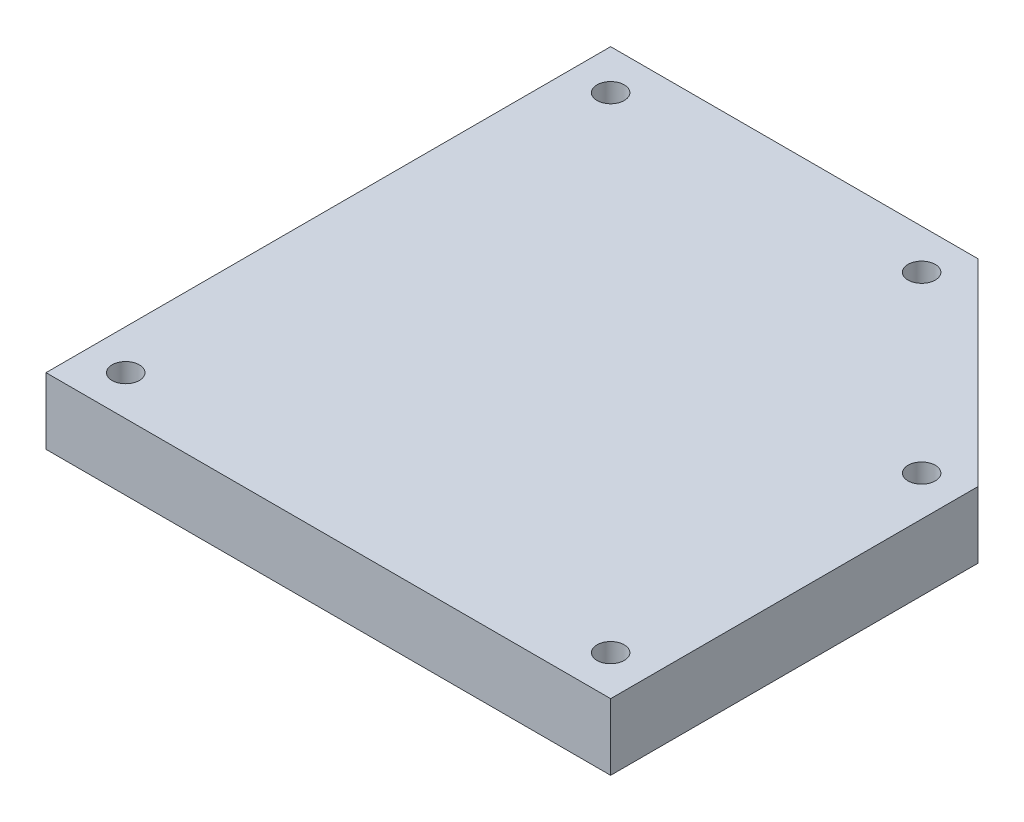
ISO-10303-21;
HEADER;
FILE_DESCRIPTION(('STEP AP214'),'2;1');
FILE_NAME('part.step','',(''),(''),'','','');
FILE_SCHEMA(('AUTOMOTIVE_DESIGN { 1 0 10303 214 1 1 1 1 }'));
ENDSEC;
DATA;
#1=APPLICATION_CONTEXT('core data for automotive mechanical design processes');
#2=APPLICATION_PROTOCOL_DEFINITION('international standard','automotive_design',2000,#1);
#3=PRODUCT_CONTEXT('',#1,'mechanical');
#4=PRODUCT('Part','Part','',(#3));
#5=PRODUCT_RELATED_PRODUCT_CATEGORY('part','',(#4));
#6=PRODUCT_DEFINITION_FORMATION('','',#4);
#7=PRODUCT_DEFINITION_CONTEXT('part definition',#1,'design');
#8=PRODUCT_DEFINITION('design','',#6,#7);
#9=PRODUCT_DEFINITION_SHAPE('','',#8);
#10=(LENGTH_UNIT() NAMED_UNIT(*) SI_UNIT(.MILLI.,.METRE.));
#11=(NAMED_UNIT(*) PLANE_ANGLE_UNIT() SI_UNIT($,.RADIAN.));
#12=(NAMED_UNIT(*) SI_UNIT($,.STERADIAN.) SOLID_ANGLE_UNIT());
#13=UNCERTAINTY_MEASURE_WITH_UNIT(LENGTH_MEASURE(1.E-05),#10,'distance_accuracy_value','');
#14=(GEOMETRIC_REPRESENTATION_CONTEXT(3) GLOBAL_UNCERTAINTY_ASSIGNED_CONTEXT((#13)) GLOBAL_UNIT_ASSIGNED_CONTEXT((#10,
#11,#12)) REPRESENTATION_CONTEXT('',''));
#15=CARTESIAN_POINT('',(0.,0.,0.));
#16=DIRECTION('',(0.,0.,1.));
#17=DIRECTION('',(1.,0.,0.));
#18=AXIS2_PLACEMENT_3D('',#15,#16,#17);
#19=CARTESIAN_POINT('',(-35.1601317484179,-0.000999999999999265,59.2039366352847));
#20=DIRECTION('',(0.,1.,0.));
#21=DIRECTION('',(0.,0.,1.));
#22=AXIS2_PLACEMENT_3D('',#19,#20,#21);
#23=CYLINDRICAL_SURFACE('',#22,2.05);
#24=CARTESIAN_POINT('',(-35.1601317484179,10.,59.2039366352847));
#25=DIRECTION('',(0.,1.,0.));
#26=DIRECTION('',(0.,0.,1.));
#27=AXIS2_PLACEMENT_3D('',#24,#25,#26);
#28=CIRCLE('',#27,2.05);
#29=CARTESIAN_POINT('',(-35.1601317484179,10.,61.2539366352847));
#30=VERTEX_POINT('',#29);
#31=EDGE_CURVE('E171',#30,#30,#28,.T.);
#32=ORIENTED_EDGE('',*,*,#31,.T.);
#33=EDGE_LOOP('',(#32));
#34=FACE_BOUND('',#33,.T.);
#35=CARTESIAN_POINT('',(-35.1601317484179,5.,59.2039366352847));
#36=DIRECTION('',(0.,-1.,0.));
#37=DIRECTION('',(0.,0.,-1.));
#38=AXIS2_PLACEMENT_3D('',#35,#36,#37);
#39=CIRCLE('',#38,2.05);
#40=CARTESIAN_POINT('',(-35.1601317484179,5.,57.1539366352847));
#41=VERTEX_POINT('',#40);
#42=EDGE_CURVE('E37',#41,#41,#39,.F.);
#43=ORIENTED_EDGE('',*,*,#42,.F.);
#44=EDGE_LOOP('',(#43));
#45=FACE_BOUND('',#44,.T.);
#46=ADVANCED_FACE('F33',(#34,#45),#23,.F.);
#47=CARTESIAN_POINT('',(-35.1601317484179,-0.000999999999999265,-13.7960633647153));
#48=DIRECTION('',(0.,1.,0.));
#49=DIRECTION('',(0.,0.,1.));
#50=AXIS2_PLACEMENT_3D('',#47,#48,#49);
#51=CYLINDRICAL_SURFACE('',#50,2.05);
#52=CARTESIAN_POINT('',(-35.1601317484179,10.,-13.7960633647153));
#53=DIRECTION('',(0.,1.,0.));
#54=DIRECTION('',(0.,0.,1.));
#55=AXIS2_PLACEMENT_3D('',#52,#53,#54);
#56=CIRCLE('',#55,2.05);
#57=CARTESIAN_POINT('',(-35.1601317484179,10.,-11.7460633647153));
#58=VERTEX_POINT('',#57);
#59=EDGE_CURVE('E168',#58,#58,#56,.T.);
#60=ORIENTED_EDGE('',*,*,#59,.T.);
#61=EDGE_LOOP('',(#60));
#62=FACE_BOUND('',#61,.T.);
#63=CARTESIAN_POINT('',(-35.1601317484179,5.,-13.7960633647153));
#64=DIRECTION('',(0.,-1.,0.));
#65=DIRECTION('',(0.,0.,-1.));
#66=AXIS2_PLACEMENT_3D('',#63,#64,#65);
#67=CIRCLE('',#66,2.05);
#68=CARTESIAN_POINT('',(-35.1601317484179,5.,-15.8460633647153));
#69=VERTEX_POINT('',#68);
#70=EDGE_CURVE('E137',#69,#69,#67,.F.);
#71=ORIENTED_EDGE('',*,*,#70,.F.);
#72=EDGE_LOOP('',(#71));
#73=FACE_BOUND('',#72,.T.);
#74=ADVANCED_FACE('F204',(#62,#73),#51,.F.);
#75=CARTESIAN_POINT('',(11.6561020675084,-0.000999999999999265,-13.7960633647153));
#76=DIRECTION('',(0.,1.,0.));
#77=DIRECTION('',(0.,0.,1.));
#78=AXIS2_PLACEMENT_3D('',#75,#76,#77);
#79=CYLINDRICAL_SURFACE('',#78,2.05);
#80=CARTESIAN_POINT('',(11.6561020675084,10.,-13.7960633647153));
#81=DIRECTION('',(0.,1.,0.));
#82=DIRECTION('',(0.,0.,1.));
#83=AXIS2_PLACEMENT_3D('',#80,#81,#82);
#84=CIRCLE('',#83,2.05);
#85=CARTESIAN_POINT('',(11.6561020675084,10.,-11.7460633647153));
#86=VERTEX_POINT('',#85);
#87=EDGE_CURVE('E126',#86,#86,#84,.T.);
#88=ORIENTED_EDGE('',*,*,#87,.T.);
#89=EDGE_LOOP('',(#88));
#90=FACE_BOUND('',#89,.T.);
#91=CARTESIAN_POINT('',(11.6561020675084,5.,-13.7960633647153));
#92=DIRECTION('',(0.,-1.,0.));
#93=DIRECTION('',(0.,0.,-1.));
#94=AXIS2_PLACEMENT_3D('',#91,#92,#93);
#95=CIRCLE('',#94,2.05);
#96=CARTESIAN_POINT('',(11.6561020675084,5.,-15.8460633647153));
#97=VERTEX_POINT('',#96);
#98=EDGE_CURVE('E133',#97,#97,#95,.F.);
#99=ORIENTED_EDGE('',*,*,#98,.F.);
#100=EDGE_LOOP('',(#99));
#101=FACE_BOUND('',#100,.T.);
#102=ADVANCED_FACE('F210',(#90,#101),#79,.F.);
#103=CARTESIAN_POINT('',(37.8398682515821,-0.000999999999999265,12.3877028193583));
#104=DIRECTION('',(0.,1.,0.));
#105=DIRECTION('',(0.,0.,1.));
#106=AXIS2_PLACEMENT_3D('',#103,#104,#105);
#107=CYLINDRICAL_SURFACE('',#106,2.05);
#108=CARTESIAN_POINT('',(37.8398682515821,10.,12.3877028193583));
#109=DIRECTION('',(0.,1.,0.));
#110=DIRECTION('',(0.,0.,1.));
#111=AXIS2_PLACEMENT_3D('',#108,#109,#110);
#112=CIRCLE('',#111,2.05);
#113=CARTESIAN_POINT('',(37.8398682515821,10.,14.4377028193583));
#114=VERTEX_POINT('',#113);
#115=EDGE_CURVE('E114',#114,#114,#112,.T.);
#116=ORIENTED_EDGE('',*,*,#115,.T.);
#117=EDGE_LOOP('',(#116));
#118=FACE_BOUND('',#117,.T.);
#119=CARTESIAN_POINT('',(37.8398682515821,5.,12.3877028193583));
#120=DIRECTION('',(0.,-1.,0.));
#121=DIRECTION('',(0.,0.,-1.));
#122=AXIS2_PLACEMENT_3D('',#119,#120,#121);
#123=CIRCLE('',#122,2.05);
#124=CARTESIAN_POINT('',(37.8398682515821,5.,10.3377028193583));
#125=VERTEX_POINT('',#124);
#126=EDGE_CURVE('E128',#125,#125,#123,.F.);
#127=ORIENTED_EDGE('',*,*,#126,.F.);
#128=EDGE_LOOP('',(#127));
#129=FACE_BOUND('',#128,.T.);
#130=ADVANCED_FACE('F219',(#118,#129),#107,.F.);
#131=CARTESIAN_POINT('',(37.8398682515821,-0.000999999999999265,59.2039366352847));
#132=DIRECTION('',(0.,1.,0.));
#133=DIRECTION('',(0.,0.,1.));
#134=AXIS2_PLACEMENT_3D('',#131,#132,#133);
#135=CYLINDRICAL_SURFACE('',#134,2.05);
#136=CARTESIAN_POINT('',(37.8398682515821,10.,59.2039366352847));
#137=DIRECTION('',(0.,1.,0.));
#138=DIRECTION('',(0.,0.,1.));
#139=AXIS2_PLACEMENT_3D('',#136,#137,#138);
#140=CIRCLE('',#139,2.05);
#141=CARTESIAN_POINT('',(37.8398682515821,10.,61.2539366352847));
#142=VERTEX_POINT('',#141);
#143=EDGE_CURVE('E174',#142,#142,#140,.T.);
#144=ORIENTED_EDGE('',*,*,#143,.T.);
#145=EDGE_LOOP('',(#144));
#146=FACE_BOUND('',#145,.T.);
#147=CARTESIAN_POINT('',(37.8398682515821,5.,59.2039366352847));
#148=DIRECTION('',(0.,-1.,0.));
#149=DIRECTION('',(0.,0.,-1.));
#150=AXIS2_PLACEMENT_3D('',#147,#148,#149);
#151=CIRCLE('',#150,2.05);
#152=CARTESIAN_POINT('',(37.8398682515821,5.,57.1539366352847));
#153=VERTEX_POINT('',#152);
#154=EDGE_CURVE('E123',#153,#153,#151,.F.);
#155=ORIENTED_EDGE('',*,*,#154,.F.);
#156=EDGE_LOOP('',(#155));
#157=FACE_BOUND('',#156,.T.);
#158=ADVANCED_FACE('F216',(#146,#157),#135,.F.);
#159=CARTESIAN_POINT('',(14.1413834417472,10.,-19.7960633647153));
#160=DIRECTION('',(0.,0.,1.));
#161=DIRECTION('',(1.,0.,0.));
#162=AXIS2_PLACEMENT_3D('',#159,#160,#161);
#163=PLANE('',#162);
#164=DIRECTION('',(-1.,0.,0.));
#165=VECTOR('',#164,1.);
#166=CARTESIAN_POINT('',(14.1413834417472,0.,-19.7960633647153));
#167=LINE('',#166,#165);
#168=CARTESIAN_POINT('',(14.1413834417472,0.,-19.7960633647153));
#169=VERTEX_POINT('',#168);
#170=CARTESIAN_POINT('',(-41.1601317484179,0.,-19.7960633647153));
#171=VERTEX_POINT('',#170);
#172=EDGE_CURVE('E110',#169,#171,#167,.T.);
#173=ORIENTED_EDGE('',*,*,#172,.T.);
#174=DIRECTION('',(0.,-1.,0.));
#175=VECTOR('',#174,1.);
#176=CARTESIAN_POINT('',(-41.1601317484179,10.,-19.7960633647153));
#177=LINE('',#176,#175);
#178=CARTESIAN_POINT('',(-41.1601317484179,10.,-19.7960633647153));
#179=VERTEX_POINT('',#178);
#180=EDGE_CURVE('E11',#179,#171,#177,.T.);
#181=ORIENTED_EDGE('',*,*,#180,.F.);
#182=DIRECTION('',(-1.,0.,0.));
#183=VECTOR('',#182,1.);
#184=CARTESIAN_POINT('',(14.1413834417472,10.,-19.7960633647153));
#185=LINE('',#184,#183);
#186=CARTESIAN_POINT('',(14.1413834417472,10.,-19.7960633647153));
#187=VERTEX_POINT('',#186);
#188=EDGE_CURVE('E119',#187,#179,#185,.T.);
#189=ORIENTED_EDGE('',*,*,#188,.F.);
#190=DIRECTION('',(0.,-1.,0.));
#191=VECTOR('',#190,1.);
#192=CARTESIAN_POINT('',(14.1413834417472,10.,-19.7960633647153));
#193=LINE('',#192,#191);
#194=EDGE_CURVE('E106',#187,#169,#193,.T.);
#195=ORIENTED_EDGE('',*,*,#194,.T.);
#196=EDGE_LOOP('',(#173,#181,#189,#195));
#197=FACE_BOUND('',#196,.T.);
#198=ADVANCED_FACE('F35',(#197),#163,.F.);
#199=CARTESIAN_POINT('',(-41.1601317484179,10.,-19.7960633647153));
#200=DIRECTION('',(1.,0.,0.));
#201=DIRECTION('',(0.,0.,-1.));
#202=AXIS2_PLACEMENT_3D('',#199,#200,#201);
#203=PLANE('',#202);
#204=DIRECTION('',(0.,0.,1.));
#205=VECTOR('',#204,1.);
#206=CARTESIAN_POINT('',(-41.1601317484179,0.,-19.7960633647153));
#207=LINE('',#206,#205);
#208=CARTESIAN_POINT('',(-41.1601317484179,0.,65.2039366352847));
#209=VERTEX_POINT('',#208);
#210=EDGE_CURVE('E113',#171,#209,#207,.T.);
#211=ORIENTED_EDGE('',*,*,#210,.T.);
#212=DIRECTION('',(0.,-1.,0.));
#213=VECTOR('',#212,1.);
#214=CARTESIAN_POINT('',(-41.1601317484179,10.,65.2039366352847));
#215=LINE('',#214,#213);
#216=CARTESIAN_POINT('',(-41.1601317484179,10.,65.2039366352847));
#217=VERTEX_POINT('',#216);
#218=EDGE_CURVE('E43',#217,#209,#215,.T.);
#219=ORIENTED_EDGE('',*,*,#218,.F.);
#220=DIRECTION('',(0.,0.,1.));
#221=VECTOR('',#220,1.);
#222=CARTESIAN_POINT('',(-41.1601317484179,10.,-19.7960633647153));
#223=LINE('',#222,#221);
#224=EDGE_CURVE('E86',#179,#217,#223,.T.);
#225=ORIENTED_EDGE('',*,*,#224,.F.);
#226=ORIENTED_EDGE('',*,*,#180,.T.);
#227=EDGE_LOOP('',(#211,#219,#225,#226));
#228=FACE_BOUND('',#227,.T.);
#229=ADVANCED_FACE('F183',(#228),#203,.F.);
#230=CARTESIAN_POINT('',(-41.1601317484179,10.,65.2039366352847));
#231=DIRECTION('',(0.,0.,-1.));
#232=DIRECTION('',(-1.,0.,0.));
#233=AXIS2_PLACEMENT_3D('',#230,#231,#232);
#234=PLANE('',#233);
#235=DIRECTION('',(1.,0.,0.));
#236=VECTOR('',#235,1.);
#237=CARTESIAN_POINT('',(-41.1601317484179,0.,65.2039366352847));
#238=LINE('',#237,#236);
#239=CARTESIAN_POINT('',(43.8398682515821,0.,65.2039366352847));
#240=VERTEX_POINT('',#239);
#241=EDGE_CURVE('E101',#209,#240,#238,.T.);
#242=ORIENTED_EDGE('',*,*,#241,.T.);
#243=DIRECTION('',(0.,-1.,0.));
#244=VECTOR('',#243,1.);
#245=CARTESIAN_POINT('',(43.8398682515821,10.,65.2039366352847));
#246=LINE('',#245,#244);
#247=CARTESIAN_POINT('',(43.8398682515821,10.,65.2039366352847));
#248=VERTEX_POINT('',#247);
#249=EDGE_CURVE('E98',#248,#240,#246,.T.);
#250=ORIENTED_EDGE('',*,*,#249,.F.);
#251=DIRECTION('',(1.,0.,0.));
#252=VECTOR('',#251,1.);
#253=CARTESIAN_POINT('',(-41.1601317484179,10.,65.2039366352847));
#254=LINE('',#253,#252);
#255=EDGE_CURVE('E90',#217,#248,#254,.T.);
#256=ORIENTED_EDGE('',*,*,#255,.F.);
#257=ORIENTED_EDGE('',*,*,#218,.T.);
#258=EDGE_LOOP('',(#242,#250,#256,#257));
#259=FACE_BOUND('',#258,.T.);
#260=ADVANCED_FACE('F99',(#259),#234,.F.);
#261=CARTESIAN_POINT('',(43.8398682515821,10.,65.2039366352847));
#262=DIRECTION('',(-1.,0.,0.));
#263=DIRECTION('',(0.,0.,1.));
#264=AXIS2_PLACEMENT_3D('',#261,#262,#263);
#265=PLANE('',#264);
#266=DIRECTION('',(0.,0.,-1.));
#267=VECTOR('',#266,1.);
#268=CARTESIAN_POINT('',(43.8398682515821,0.,65.2039366352847));
#269=LINE('',#268,#267);
#270=CARTESIAN_POINT('',(43.8398682515821,0.,9.90242144511974));
#271=VERTEX_POINT('',#270);
#272=EDGE_CURVE('E72',#240,#271,#269,.T.);
#273=ORIENTED_EDGE('',*,*,#272,.T.);
#274=DIRECTION('',(0.,-1.,0.));
#275=VECTOR('',#274,1.);
#276=CARTESIAN_POINT('',(43.8398682515821,10.,9.90242144511974));
#277=LINE('',#276,#275);
#278=CARTESIAN_POINT('',(43.8398682515821,10.,9.90242144511974));
#279=VERTEX_POINT('',#278);
#280=EDGE_CURVE('E102',#279,#271,#277,.T.);
#281=ORIENTED_EDGE('',*,*,#280,.F.);
#282=DIRECTION('',(0.,0.,-1.));
#283=VECTOR('',#282,1.);
#284=CARTESIAN_POINT('',(43.8398682515821,10.,65.2039366352847));
#285=LINE('',#284,#283);
#286=EDGE_CURVE('E94',#248,#279,#285,.T.);
#287=ORIENTED_EDGE('',*,*,#286,.F.);
#288=ORIENTED_EDGE('',*,*,#249,.T.);
#289=EDGE_LOOP('',(#273,#281,#287,#288));
#290=FACE_BOUND('',#289,.T.);
#291=ADVANCED_FACE('F104',(#290),#265,.F.);
#292=CARTESIAN_POINT('',(43.8398682515821,10.,9.90242144511974));
#293=DIRECTION('',(-0.707106781186549,0.,0.707106781186546));
#294=DIRECTION('',(0.707106781186546,0.,0.707106781186549));
#295=AXIS2_PLACEMENT_3D('',#292,#293,#294);
#296=PLANE('',#295);
#297=DIRECTION('',(-0.707106781186545,0.,-0.707106781186549));
#298=VECTOR('',#297,1.);
#299=CARTESIAN_POINT('',(43.8398682515821,0.,9.90242144511974));
#300=LINE('',#299,#298);
#301=EDGE_CURVE('E78',#271,#169,#300,.T.);
#302=ORIENTED_EDGE('',*,*,#301,.T.);
#303=ORIENTED_EDGE('',*,*,#194,.F.);
#304=DIRECTION('',(-0.707106781186545,0.,-0.707106781186549));
#305=VECTOR('',#304,1.);
#306=CARTESIAN_POINT('',(43.8398682515821,10.,9.90242144511974));
#307=LINE('',#306,#305);
#308=EDGE_CURVE('E52',#279,#187,#307,.T.);
#309=ORIENTED_EDGE('',*,*,#308,.F.);
#310=ORIENTED_EDGE('',*,*,#280,.T.);
#311=EDGE_LOOP('',(#302,#303,#309,#310));
#312=FACE_BOUND('',#311,.T.);
#313=ADVANCED_FACE('F197',(#312),#296,.F.);
#314=CARTESIAN_POINT('',(0.,10.,0.));
#315=DIRECTION('',(0.,1.,0.));
#316=DIRECTION('',(0.,0.,1.));
#317=AXIS2_PLACEMENT_3D('',#314,#315,#316);
#318=PLANE('',#317);
#319=ORIENTED_EDGE('',*,*,#87,.F.);
#320=EDGE_LOOP('',(#319));
#321=FACE_BOUND('',#320,.T.);
#322=ORIENTED_EDGE('',*,*,#59,.F.);
#323=EDGE_LOOP('',(#322));
#324=FACE_BOUND('',#323,.T.);
#325=ORIENTED_EDGE('',*,*,#31,.F.);
#326=EDGE_LOOP('',(#325));
#327=FACE_BOUND('',#326,.T.);
#328=ORIENTED_EDGE('',*,*,#143,.F.);
#329=EDGE_LOOP('',(#328));
#330=FACE_BOUND('',#329,.T.);
#331=ORIENTED_EDGE('',*,*,#115,.F.);
#332=EDGE_LOOP('',(#331));
#333=FACE_BOUND('',#332,.T.);
#334=ORIENTED_EDGE('',*,*,#188,.T.);
#335=ORIENTED_EDGE('',*,*,#224,.T.);
#336=ORIENTED_EDGE('',*,*,#255,.T.);
#337=ORIENTED_EDGE('',*,*,#286,.T.);
#338=ORIENTED_EDGE('',*,*,#308,.T.);
#339=EDGE_LOOP('',(#334,#335,#336,#337,#338));
#340=FACE_BOUND('',#339,.T.);
#341=ADVANCED_FACE('F92',(#321,#324,#327,#330,#333,#340),#318,.T.);
#342=CARTESIAN_POINT('',(0.,0.,0.));
#343=DIRECTION('',(0.,1.,0.));
#344=DIRECTION('',(0.,0.,1.));
#345=AXIS2_PLACEMENT_3D('',#342,#343,#344);
#346=PLANE('',#345);
#347=CARTESIAN_POINT('',(-35.1601317484179,0.,59.2039366352847));
#348=DIRECTION('',(0.,-1.,0.));
#349=DIRECTION('',(0.,0.,-1.));
#350=AXIS2_PLACEMENT_3D('',#347,#348,#349);
#351=CIRCLE('',#350,4.);
#352=CARTESIAN_POINT('',(-35.1601317484179,0.,55.2039366352847));
#353=VERTEX_POINT('',#352);
#354=EDGE_CURVE('E153',#353,#353,#351,.T.);
#355=ORIENTED_EDGE('',*,*,#354,.F.);
#356=EDGE_LOOP('',(#355));
#357=FACE_BOUND('',#356,.T.);
#358=CARTESIAN_POINT('',(-35.1601317484179,0.,-13.7960633647153));
#359=DIRECTION('',(0.,-1.,0.));
#360=DIRECTION('',(0.,0.,-1.));
#361=AXIS2_PLACEMENT_3D('',#358,#359,#360);
#362=CIRCLE('',#361,4.);
#363=CARTESIAN_POINT('',(-35.1601317484179,0.,-17.7960633647153));
#364=VERTEX_POINT('',#363);
#365=EDGE_CURVE('E146',#364,#364,#362,.T.);
#366=ORIENTED_EDGE('',*,*,#365,.F.);
#367=EDGE_LOOP('',(#366));
#368=FACE_BOUND('',#367,.T.);
#369=CARTESIAN_POINT('',(11.6561020675084,0.,-13.7960633647153));
#370=DIRECTION('',(0.,-1.,0.));
#371=DIRECTION('',(0.,0.,-1.));
#372=AXIS2_PLACEMENT_3D('',#369,#370,#371);
#373=CIRCLE('',#372,4.);
#374=CARTESIAN_POINT('',(11.6561020675084,0.,-17.7960633647153));
#375=VERTEX_POINT('',#374);
#376=EDGE_CURVE('E139',#375,#375,#373,.T.);
#377=ORIENTED_EDGE('',*,*,#376,.F.);
#378=EDGE_LOOP('',(#377));
#379=FACE_BOUND('',#378,.T.);
#380=CARTESIAN_POINT('',(37.8398682515821,0.,12.3877028193583));
#381=DIRECTION('',(0.,-1.,0.));
#382=DIRECTION('',(0.,0.,-1.));
#383=AXIS2_PLACEMENT_3D('',#380,#381,#382);
#384=CIRCLE('',#383,4.);
#385=CARTESIAN_POINT('',(37.8398682515821,0.,8.38770281935832));
#386=VERTEX_POINT('',#385);
#387=EDGE_CURVE('E135',#386,#386,#384,.T.);
#388=ORIENTED_EDGE('',*,*,#387,.F.);
#389=EDGE_LOOP('',(#388));
#390=FACE_BOUND('',#389,.T.);
#391=CARTESIAN_POINT('',(37.8398682515821,0.,59.2039366352847));
#392=DIRECTION('',(0.,-1.,0.));
#393=DIRECTION('',(0.,0.,-1.));
#394=AXIS2_PLACEMENT_3D('',#391,#392,#393);
#395=CIRCLE('',#394,4.);
#396=CARTESIAN_POINT('',(37.8398682515821,0.,55.2039366352847));
#397=VERTEX_POINT('',#396);
#398=EDGE_CURVE('E131',#397,#397,#395,.T.);
#399=ORIENTED_EDGE('',*,*,#398,.F.);
#400=EDGE_LOOP('',(#399));
#401=FACE_BOUND('',#400,.T.);
#402=ORIENTED_EDGE('',*,*,#172,.F.);
#403=ORIENTED_EDGE('',*,*,#301,.F.);
#404=ORIENTED_EDGE('',*,*,#272,.F.);
#405=ORIENTED_EDGE('',*,*,#241,.F.);
#406=ORIENTED_EDGE('',*,*,#210,.F.);
#407=EDGE_LOOP('',(#402,#403,#404,#405,#406));
#408=FACE_BOUND('',#407,.T.);
#409=ADVANCED_FACE('F185',(#357,#368,#379,#390,#401,#408),#346,.F.);
#410=CARTESIAN_POINT('',(37.8398682515821,5.,59.2039366352847));
#411=DIRECTION('',(0.,-1.,0.));
#412=DIRECTION('',(0.,0.,-1.));
#413=AXIS2_PLACEMENT_3D('',#410,#411,#412);
#414=PLANE('',#413);
#415=CARTESIAN_POINT('',(37.8398682515821,5.,59.2039366352847));
#416=DIRECTION('',(0.,-1.,0.));
#417=DIRECTION('',(0.,0.,-1.));
#418=AXIS2_PLACEMENT_3D('',#415,#416,#417);
#419=CIRCLE('',#418,4.);
#420=CARTESIAN_POINT('',(37.8398682515821,5.,55.2039366352847));
#421=VERTEX_POINT('',#420);
#422=EDGE_CURVE('E127',#421,#421,#419,.T.);
#423=ORIENTED_EDGE('',*,*,#422,.T.);
#424=EDGE_LOOP('',(#423));
#425=FACE_BOUND('',#424,.T.);
#426=ORIENTED_EDGE('',*,*,#154,.T.);
#427=EDGE_LOOP('',(#426));
#428=FACE_BOUND('',#427,.T.);
#429=ADVANCED_FACE('F187',(#425,#428),#414,.T.);
#430=CARTESIAN_POINT('',(37.8398682515821,5.,59.2039366352847));
#431=DIRECTION('',(0.,-1.,0.));
#432=DIRECTION('',(0.,0.,-1.));
#433=AXIS2_PLACEMENT_3D('',#430,#431,#432);
#434=CYLINDRICAL_SURFACE('',#433,4.);
#435=ORIENTED_EDGE('',*,*,#422,.F.);
#436=EDGE_LOOP('',(#435));
#437=FACE_BOUND('',#436,.T.);
#438=ORIENTED_EDGE('',*,*,#398,.T.);
#439=EDGE_LOOP('',(#438));
#440=FACE_BOUND('',#439,.T.);
#441=ADVANCED_FACE('F194',(#437,#440),#434,.F.);
#442=CARTESIAN_POINT('',(37.8398682515821,5.,12.3877028193583));
#443=DIRECTION('',(0.,-1.,0.));
#444=DIRECTION('',(0.,0.,-1.));
#445=AXIS2_PLACEMENT_3D('',#442,#443,#444);
#446=PLANE('',#445);
#447=CARTESIAN_POINT('',(37.8398682515821,5.,12.3877028193583));
#448=DIRECTION('',(0.,-1.,0.));
#449=DIRECTION('',(0.,0.,-1.));
#450=AXIS2_PLACEMENT_3D('',#447,#448,#449);
#451=CIRCLE('',#450,4.);
#452=CARTESIAN_POINT('',(37.8398682515821,5.,8.38770281935832));
#453=VERTEX_POINT('',#452);
#454=EDGE_CURVE('E132',#453,#453,#451,.T.);
#455=ORIENTED_EDGE('',*,*,#454,.T.);
#456=EDGE_LOOP('',(#455));
#457=FACE_BOUND('',#456,.T.);
#458=ORIENTED_EDGE('',*,*,#126,.T.);
#459=EDGE_LOOP('',(#458));
#460=FACE_BOUND('',#459,.T.);
#461=ADVANCED_FACE('F231',(#457,#460),#446,.T.);
#462=CARTESIAN_POINT('',(37.8398682515821,5.,12.3877028193583));
#463=DIRECTION('',(0.,-1.,0.));
#464=DIRECTION('',(0.,0.,-1.));
#465=AXIS2_PLACEMENT_3D('',#462,#463,#464);
#466=CYLINDRICAL_SURFACE('',#465,4.);
#467=ORIENTED_EDGE('',*,*,#454,.F.);
#468=EDGE_LOOP('',(#467));
#469=FACE_BOUND('',#468,.T.);
#470=ORIENTED_EDGE('',*,*,#387,.T.);
#471=EDGE_LOOP('',(#470));
#472=FACE_BOUND('',#471,.T.);
#473=ADVANCED_FACE('F233',(#469,#472),#466,.F.);
#474=CARTESIAN_POINT('',(11.6561020675084,5.,-13.7960633647153));
#475=DIRECTION('',(0.,-1.,0.));
#476=DIRECTION('',(0.,0.,-1.));
#477=AXIS2_PLACEMENT_3D('',#474,#475,#476);
#478=PLANE('',#477);
#479=CARTESIAN_POINT('',(11.6561020675084,5.,-13.7960633647153));
#480=DIRECTION('',(0.,-1.,0.));
#481=DIRECTION('',(0.,0.,-1.));
#482=AXIS2_PLACEMENT_3D('',#479,#480,#481);
#483=CIRCLE('',#482,4.);
#484=CARTESIAN_POINT('',(11.6561020675084,5.,-17.7960633647153));
#485=VERTEX_POINT('',#484);
#486=EDGE_CURVE('E136',#485,#485,#483,.T.);
#487=ORIENTED_EDGE('',*,*,#486,.T.);
#488=EDGE_LOOP('',(#487));
#489=FACE_BOUND('',#488,.T.);
#490=ORIENTED_EDGE('',*,*,#98,.T.);
#491=EDGE_LOOP('',(#490));
#492=FACE_BOUND('',#491,.T.);
#493=ADVANCED_FACE('F240',(#489,#492),#478,.T.);
#494=CARTESIAN_POINT('',(11.6561020675084,5.,-13.7960633647153));
#495=DIRECTION('',(0.,-1.,0.));
#496=DIRECTION('',(0.,0.,-1.));
#497=AXIS2_PLACEMENT_3D('',#494,#495,#496);
#498=CYLINDRICAL_SURFACE('',#497,4.);
#499=ORIENTED_EDGE('',*,*,#486,.F.);
#500=EDGE_LOOP('',(#499));
#501=FACE_BOUND('',#500,.T.);
#502=ORIENTED_EDGE('',*,*,#376,.T.);
#503=EDGE_LOOP('',(#502));
#504=FACE_BOUND('',#503,.T.);
#505=ADVANCED_FACE('F246',(#501,#504),#498,.F.);
#506=CARTESIAN_POINT('',(-35.1601317484179,5.,-13.7960633647153));
#507=DIRECTION('',(0.,-1.,0.));
#508=DIRECTION('',(0.,0.,-1.));
#509=AXIS2_PLACEMENT_3D('',#506,#507,#508);
#510=PLANE('',#509);
#511=CARTESIAN_POINT('',(-35.1601317484179,5.,-13.7960633647153));
#512=DIRECTION('',(0.,-1.,0.));
#513=DIRECTION('',(0.,0.,-1.));
#514=AXIS2_PLACEMENT_3D('',#511,#512,#513);
#515=CIRCLE('',#514,4.);
#516=CARTESIAN_POINT('',(-35.1601317484179,5.,-17.7960633647153));
#517=VERTEX_POINT('',#516);
#518=EDGE_CURVE('E140',#517,#517,#515,.T.);
#519=ORIENTED_EDGE('',*,*,#518,.T.);
#520=EDGE_LOOP('',(#519));
#521=FACE_BOUND('',#520,.T.);
#522=ORIENTED_EDGE('',*,*,#70,.T.);
#523=EDGE_LOOP('',(#522));
#524=FACE_BOUND('',#523,.T.);
#525=ADVANCED_FACE('F249',(#521,#524),#510,.T.);
#526=CARTESIAN_POINT('',(-35.1601317484179,5.,-13.7960633647153));
#527=DIRECTION('',(0.,-1.,0.));
#528=DIRECTION('',(0.,0.,-1.));
#529=AXIS2_PLACEMENT_3D('',#526,#527,#528);
#530=CYLINDRICAL_SURFACE('',#529,4.);
#531=ORIENTED_EDGE('',*,*,#518,.F.);
#532=EDGE_LOOP('',(#531));
#533=FACE_BOUND('',#532,.T.);
#534=ORIENTED_EDGE('',*,*,#365,.T.);
#535=EDGE_LOOP('',(#534));
#536=FACE_BOUND('',#535,.T.);
#537=ADVANCED_FACE('F254',(#533,#536),#530,.F.);
#538=CARTESIAN_POINT('',(-35.1601317484179,5.,59.2039366352847));
#539=DIRECTION('',(0.,-1.,0.));
#540=DIRECTION('',(0.,0.,-1.));
#541=AXIS2_PLACEMENT_3D('',#538,#539,#540);
#542=PLANE('',#541);
#543=CARTESIAN_POINT('',(-35.1601317484179,5.,59.2039366352847));
#544=DIRECTION('',(0.,-1.,0.));
#545=DIRECTION('',(0.,0.,-1.));
#546=AXIS2_PLACEMENT_3D('',#543,#544,#545);
#547=CIRCLE('',#546,4.);
#548=CARTESIAN_POINT('',(-35.1601317484179,5.,55.2039366352847));
#549=VERTEX_POINT('',#548);
#550=EDGE_CURVE('E272',#549,#549,#547,.T.);
#551=ORIENTED_EDGE('',*,*,#550,.T.);
#552=EDGE_LOOP('',(#551));
#553=FACE_BOUND('',#552,.T.);
#554=ORIENTED_EDGE('',*,*,#42,.T.);
#555=EDGE_LOOP('',(#554));
#556=FACE_BOUND('',#555,.T.);
#557=ADVANCED_FACE('F257',(#553,#556),#542,.T.);
#558=CARTESIAN_POINT('',(-35.1601317484179,5.,59.2039366352847));
#559=DIRECTION('',(0.,-1.,0.));
#560=DIRECTION('',(0.,0.,-1.));
#561=AXIS2_PLACEMENT_3D('',#558,#559,#560);
#562=CYLINDRICAL_SURFACE('',#561,4.);
#563=ORIENTED_EDGE('',*,*,#550,.F.);
#564=EDGE_LOOP('',(#563));
#565=FACE_BOUND('',#564,.T.);
#566=ORIENTED_EDGE('',*,*,#354,.T.);
#567=EDGE_LOOP('',(#566));
#568=FACE_BOUND('',#567,.T.);
#569=ADVANCED_FACE('F261',(#565,#568),#562,.F.);
#570=CLOSED_SHELL('',(#46,#74,#102,#130,#158,#198,#229,#260,#291,#313,#341,#409,#429,#441,#461,
#473,#493,#505,#525,#537,#557,#569));
#571=MANIFOLD_SOLID_BREP('B2',#570);
#572=ADVANCED_BREP_SHAPE_REPRESENTATION('',(#18,#571),#14);
#573=SHAPE_DEFINITION_REPRESENTATION(#9,#572);
ENDSEC;
END-ISO-10303-21;
